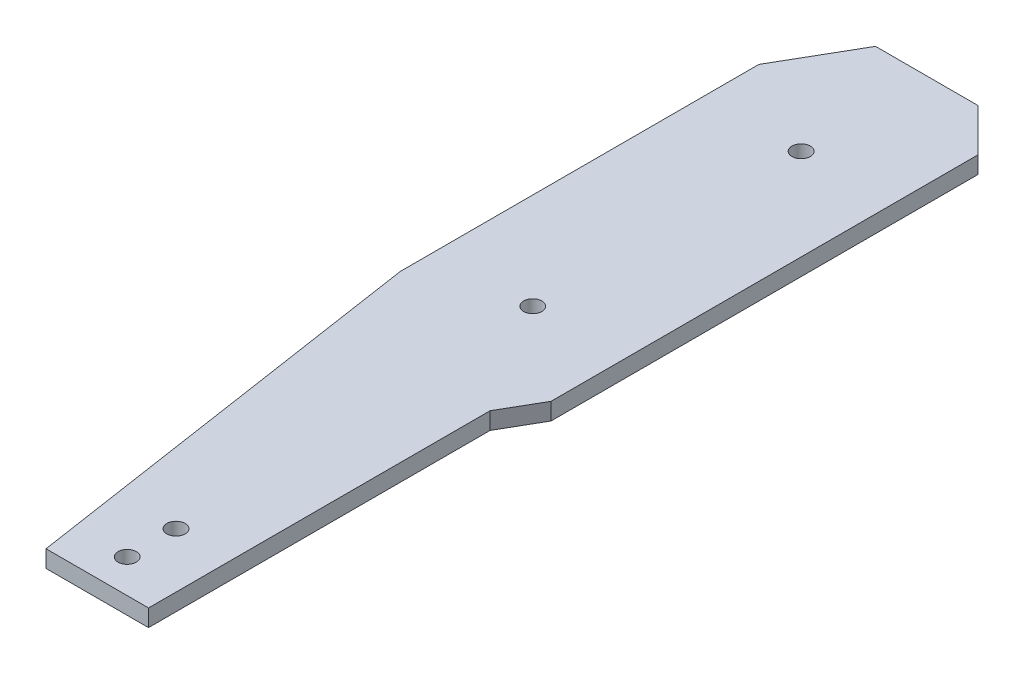
ISO-10303-21;
HEADER;
FILE_DESCRIPTION(('STEP AP214'),'2;1');
FILE_NAME('part.step','',(''),(''),'','','');
FILE_SCHEMA(('AUTOMOTIVE_DESIGN { 1 0 10303 214 1 1 1 1 }'));
ENDSEC;
DATA;
#1=APPLICATION_CONTEXT('core data for automotive mechanical design processes');
#2=APPLICATION_PROTOCOL_DEFINITION('international standard','automotive_design',2000,#1);
#3=PRODUCT_CONTEXT('',#1,'mechanical');
#4=PRODUCT('Part','Part','',(#3));
#5=PRODUCT_RELATED_PRODUCT_CATEGORY('part','',(#4));
#6=PRODUCT_DEFINITION_FORMATION('','',#4);
#7=PRODUCT_DEFINITION_CONTEXT('part definition',#1,'design');
#8=PRODUCT_DEFINITION('design','',#6,#7);
#9=PRODUCT_DEFINITION_SHAPE('','',#8);
#10=(LENGTH_UNIT() NAMED_UNIT(*) SI_UNIT(.MILLI.,.METRE.));
#11=(NAMED_UNIT(*) PLANE_ANGLE_UNIT() SI_UNIT($,.RADIAN.));
#12=(NAMED_UNIT(*) SI_UNIT($,.STERADIAN.) SOLID_ANGLE_UNIT());
#13=UNCERTAINTY_MEASURE_WITH_UNIT(LENGTH_MEASURE(1.E-05),#10,'distance_accuracy_value','');
#14=(GEOMETRIC_REPRESENTATION_CONTEXT(3) GLOBAL_UNCERTAINTY_ASSIGNED_CONTEXT((#13)) GLOBAL_UNIT_ASSIGNED_CONTEXT((#10,
#11,#12)) REPRESENTATION_CONTEXT('',''));
#15=CARTESIAN_POINT('',(0.,0.,0.));
#16=DIRECTION('',(0.,0.,1.));
#17=DIRECTION('',(1.,0.,0.));
#18=AXIS2_PLACEMENT_3D('',#15,#16,#17);
#19=CARTESIAN_POINT('',(11.0006442925217,2.4,-72.5139862302894));
#20=DIRECTION('',(-0.707106781186549,0.,0.707106781186546));
#21=DIRECTION('',(0.707106781186546,0.,0.707106781186549));
#22=AXIS2_PLACEMENT_3D('',#19,#20,#21);
#23=PLANE('',#22);
#24=DIRECTION('',(-0.707106781186546,0.,-0.707106781186549));
#25=VECTOR('',#24,1.);
#26=CARTESIAN_POINT('',(11.0006442925217,-0.4,-72.5139862302894));
#27=LINE('',#26,#25);
#28=CARTESIAN_POINT('',(11.0006442925217,-0.4,-72.5139862302894));
#29=VERTEX_POINT('',#28);
#30=CARTESIAN_POINT('',(4.00064429252166,-0.4,-79.5139862302895));
#31=VERTEX_POINT('',#30);
#32=EDGE_CURVE('E137',#29,#31,#27,.T.);
#33=ORIENTED_EDGE('',*,*,#32,.T.);
#34=DIRECTION('',(0.,-1.,0.));
#35=VECTOR('',#34,1.);
#36=CARTESIAN_POINT('',(4.00064429252166,2.4,-79.5139862302895));
#37=LINE('',#36,#35);
#38=CARTESIAN_POINT('',(4.00064429252166,2.4,-79.5139862302895));
#39=VERTEX_POINT('',#38);
#40=EDGE_CURVE('E11',#39,#31,#37,.T.);
#41=ORIENTED_EDGE('',*,*,#40,.F.);
#42=DIRECTION('',(-0.707106781186546,0.,-0.707106781186549));
#43=VECTOR('',#42,1.);
#44=CARTESIAN_POINT('',(11.0006442925217,2.4,-72.5139862302894));
#45=LINE('',#44,#43);
#46=CARTESIAN_POINT('',(11.0006442925217,2.4,-72.5139862302894));
#47=VERTEX_POINT('',#46);
#48=EDGE_CURVE('E154',#47,#39,#45,.T.);
#49=ORIENTED_EDGE('',*,*,#48,.F.);
#50=DIRECTION('',(0.,-1.,0.));
#51=VECTOR('',#50,1.);
#52=CARTESIAN_POINT('',(11.0006442925217,2.4,-72.5139862302894));
#53=LINE('',#52,#51);
#54=EDGE_CURVE('E133',#47,#29,#53,.T.);
#55=ORIENTED_EDGE('',*,*,#54,.T.);
#56=EDGE_LOOP('',(#33,#41,#49,#55));
#57=FACE_BOUND('',#56,.T.);
#58=ADVANCED_FACE('F35',(#57),#23,.F.);
#59=CARTESIAN_POINT('',(4.00064429252166,2.4,-79.5139862302895));
#60=DIRECTION('',(0.,0.,1.));
#61=DIRECTION('',(1.,0.,0.));
#62=AXIS2_PLACEMENT_3D('',#59,#60,#61);
#63=PLANE('',#62);
#64=DIRECTION('',(-1.,0.,0.));
#65=VECTOR('',#64,1.);
#66=CARTESIAN_POINT('',(4.00064429252166,-0.4,-79.5139862302895));
#67=LINE('',#66,#65);
#68=CARTESIAN_POINT('',(-12.7993557074783,-0.4,-79.5139862302895));
#69=VERTEX_POINT('',#68);
#70=EDGE_CURVE('E140',#31,#69,#67,.T.);
#71=ORIENTED_EDGE('',*,*,#70,.T.);
#72=DIRECTION('',(0.,-1.,0.));
#73=VECTOR('',#72,1.);
#74=CARTESIAN_POINT('',(-12.7993557074783,2.4,-79.5139862302895));
#75=LINE('',#74,#73);
#76=CARTESIAN_POINT('',(-12.7993557074783,2.4,-79.5139862302895));
#77=VERTEX_POINT('',#76);
#78=EDGE_CURVE('E43',#77,#69,#75,.T.);
#79=ORIENTED_EDGE('',*,*,#78,.F.);
#80=DIRECTION('',(-1.,0.,0.));
#81=VECTOR('',#80,1.);
#82=CARTESIAN_POINT('',(4.00064429252166,2.4,-79.5139862302895));
#83=LINE('',#82,#81);
#84=EDGE_CURVE('E97',#39,#77,#83,.T.);
#85=ORIENTED_EDGE('',*,*,#84,.F.);
#86=ORIENTED_EDGE('',*,*,#40,.T.);
#87=EDGE_LOOP('',(#71,#79,#85,#86));
#88=FACE_BOUND('',#87,.T.);
#89=ADVANCED_FACE('F252',(#88),#63,.F.);
#90=CARTESIAN_POINT('',(-12.7993557074783,2.4,-79.5139862302895));
#91=DIRECTION('',(0.866025403784441,0.,0.499999999999997));
#92=DIRECTION('',(0.499999999999997,0.,-0.866025403784441));
#93=AXIS2_PLACEMENT_3D('',#90,#91,#92);
#94=PLANE('',#93);
#95=DIRECTION('',(-0.499999999999997,0.,0.866025403784441));
#96=VECTOR('',#95,1.);
#97=CARTESIAN_POINT('',(-12.7993557074783,-0.4,-79.5139862302895));
#98=LINE('',#97,#96);
#99=CARTESIAN_POINT('',(-19.7993557074783,-0.4,-67.3896305773073));
#100=VERTEX_POINT('',#99);
#101=EDGE_CURVE('E143',#69,#100,#98,.T.);
#102=ORIENTED_EDGE('',*,*,#101,.T.);
#103=DIRECTION('',(0.,-1.,0.));
#104=VECTOR('',#103,1.);
#105=CARTESIAN_POINT('',(-19.7993557074783,2.4,-67.3896305773073));
#106=LINE('',#105,#104);
#107=CARTESIAN_POINT('',(-19.7993557074783,2.4,-67.3896305773073));
#108=VERTEX_POINT('',#107);
#109=EDGE_CURVE('E164',#108,#100,#106,.T.);
#110=ORIENTED_EDGE('',*,*,#109,.F.);
#111=DIRECTION('',(-0.499999999999997,0.,0.866025403784441));
#112=VECTOR('',#111,1.);
#113=CARTESIAN_POINT('',(-12.7993557074783,2.4,-79.5139862302895));
#114=LINE('',#113,#112);
#115=EDGE_CURVE('E172',#77,#108,#114,.T.);
#116=ORIENTED_EDGE('',*,*,#115,.F.);
#117=ORIENTED_EDGE('',*,*,#78,.T.);
#118=EDGE_LOOP('',(#102,#110,#116,#117));
#119=FACE_BOUND('',#118,.T.);
#120=ADVANCED_FACE('F170',(#119),#94,.F.);
#121=CARTESIAN_POINT('',(-19.7993557074783,2.4,-67.3896305773073));
#122=DIRECTION('',(1.,0.,0.));
#123=DIRECTION('',(0.,0.,-1.));
#124=AXIS2_PLACEMENT_3D('',#121,#122,#123);
#125=PLANE('',#124);
#126=DIRECTION('',(0.,0.,1.));
#127=VECTOR('',#126,1.);
#128=CARTESIAN_POINT('',(-19.7993557074783,-0.4,-67.3896305773073));
#129=LINE('',#128,#127);
#130=CARTESIAN_POINT('',(-19.7993557074783,-0.4,-8.58963057730734));
#131=VERTEX_POINT('',#130);
#132=EDGE_CURVE('E145',#100,#131,#129,.T.);
#133=ORIENTED_EDGE('',*,*,#132,.T.);
#134=DIRECTION('',(0.,-1.,0.));
#135=VECTOR('',#134,1.);
#136=CARTESIAN_POINT('',(-19.7993557074783,2.4,-8.58963057730734));
#137=LINE('',#136,#135);
#138=CARTESIAN_POINT('',(-19.7993557074783,2.4,-8.58963057730734));
#139=VERTEX_POINT('',#138);
#140=EDGE_CURVE('E161',#139,#131,#137,.T.);
#141=ORIENTED_EDGE('',*,*,#140,.F.);
#142=DIRECTION('',(0.,0.,1.));
#143=VECTOR('',#142,1.);
#144=CARTESIAN_POINT('',(-19.7993557074783,2.4,-67.3896305773073));
#145=LINE('',#144,#143);
#146=EDGE_CURVE('E188',#108,#139,#145,.T.);
#147=ORIENTED_EDGE('',*,*,#146,.F.);
#148=ORIENTED_EDGE('',*,*,#109,.T.);
#149=EDGE_LOOP('',(#133,#141,#147,#148));
#150=FACE_BOUND('',#149,.T.);
#151=ADVANCED_FACE('F181',(#150),#125,.F.);
#152=CARTESIAN_POINT('',(-19.7993557074783,2.4,-8.58963057730734));
#153=DIRECTION('',(0.98878955641678,0.,-0.149315816714463));
#154=DIRECTION('',(-0.149315816714463,0.,-0.98878955641678));
#155=AXIS2_PLACEMENT_3D('',#152,#153,#154);
#156=PLANE('',#155);
#157=DIRECTION('',(0.149315816714463,0.,0.98878955641678));
#158=VECTOR('',#157,1.);
#159=CARTESIAN_POINT('',(-19.7993557074783,-0.4,-8.58963057730734));
#160=LINE('',#159,#158);
#161=CARTESIAN_POINT('',(-9.46839493803335,-0.4,59.8233905034605));
#162=VERTEX_POINT('',#161);
#163=EDGE_CURVE('E147',#131,#162,#160,.T.);
#164=ORIENTED_EDGE('',*,*,#163,.T.);
#165=DIRECTION('',(0.,-1.,0.));
#166=VECTOR('',#165,1.);
#167=CARTESIAN_POINT('',(-9.46839493803335,2.4,59.8233905034605));
#168=LINE('',#167,#166);
#169=CARTESIAN_POINT('',(-9.46839493803335,2.4,59.8233905034605));
#170=VERTEX_POINT('',#169);
#171=EDGE_CURVE('E158',#170,#162,#168,.T.);
#172=ORIENTED_EDGE('',*,*,#171,.F.);
#173=DIRECTION('',(0.149315816714463,0.,0.98878955641678));
#174=VECTOR('',#173,1.);
#175=CARTESIAN_POINT('',(-19.7993557074783,2.4,-8.58963057730734));
#176=LINE('',#175,#174);
#177=EDGE_CURVE('E187',#139,#170,#176,.T.);
#178=ORIENTED_EDGE('',*,*,#177,.F.);
#179=ORIENTED_EDGE('',*,*,#140,.T.);
#180=EDGE_LOOP('',(#164,#172,#178,#179));
#181=FACE_BOUND('',#180,.T.);
#182=ADVANCED_FACE('F185',(#181),#156,.F.);
#183=CARTESIAN_POINT('',(-9.46839493803335,2.4,59.8233905034605));
#184=DIRECTION('',(0.,0.,-1.));
#185=DIRECTION('',(-1.,0.,0.));
#186=AXIS2_PLACEMENT_3D('',#183,#184,#185);
#187=PLANE('',#186);
#188=DIRECTION('',(1.,0.,0.));
#189=VECTOR('',#188,1.);
#190=CARTESIAN_POINT('',(-9.46839493803335,-0.4,59.8233905034605));
#191=LINE('',#190,#189);
#192=CARTESIAN_POINT('',(7.34175812933514,-0.4,59.8233905034605));
#193=VERTEX_POINT('',#192);
#194=EDGE_CURVE('E149',#162,#193,#191,.T.);
#195=ORIENTED_EDGE('',*,*,#194,.T.);
#196=DIRECTION('',(0.,-1.,0.));
#197=VECTOR('',#196,1.);
#198=CARTESIAN_POINT('',(7.34175812933514,2.4,59.8233905034605));
#199=LINE('',#198,#197);
#200=CARTESIAN_POINT('',(7.34175812933514,2.4,59.8233905034605));
#201=VERTEX_POINT('',#200);
#202=EDGE_CURVE('E128',#201,#193,#199,.T.);
#203=ORIENTED_EDGE('',*,*,#202,.F.);
#204=DIRECTION('',(1.,0.,0.));
#205=VECTOR('',#204,1.);
#206=CARTESIAN_POINT('',(-9.46839493803335,2.4,59.8233905034605));
#207=LINE('',#206,#205);
#208=EDGE_CURVE('E119',#170,#201,#207,.T.);
#209=ORIENTED_EDGE('',*,*,#208,.F.);
#210=ORIENTED_EDGE('',*,*,#171,.T.);
#211=EDGE_LOOP('',(#195,#203,#209,#210));
#212=FACE_BOUND('',#211,.T.);
#213=ADVANCED_FACE('F260',(#212),#187,.F.);
#214=CARTESIAN_POINT('',(7.34175812933514,2.4,59.8233905034605));
#215=DIRECTION('',(-1.,0.,0.));
#216=DIRECTION('',(0.,0.,1.));
#217=AXIS2_PLACEMENT_3D('',#214,#215,#216);
#218=PLANE('',#217);
#219=DIRECTION('',(0.,0.,-1.));
#220=VECTOR('',#219,1.);
#221=CARTESIAN_POINT('',(7.34175812933514,-0.4,59.8233905034605));
#222=LINE('',#221,#220);
#223=CARTESIAN_POINT('',(7.34175812933515,-0.4,3.82339050346049));
#224=VERTEX_POINT('',#223);
#225=EDGE_CURVE('E127',#193,#224,#222,.T.);
#226=ORIENTED_EDGE('',*,*,#225,.T.);
#227=DIRECTION('',(0.,-1.,0.));
#228=VECTOR('',#227,1.);
#229=CARTESIAN_POINT('',(7.34175812933515,2.4,3.82339050346049));
#230=LINE('',#229,#228);
#231=CARTESIAN_POINT('',(7.34175812933515,2.4,3.82339050346049));
#232=VERTEX_POINT('',#231);
#233=EDGE_CURVE('E124',#232,#224,#230,.T.);
#234=ORIENTED_EDGE('',*,*,#233,.F.);
#235=DIRECTION('',(0.,0.,-1.));
#236=VECTOR('',#235,1.);
#237=CARTESIAN_POINT('',(7.34175812933514,2.4,59.8233905034605));
#238=LINE('',#237,#236);
#239=EDGE_CURVE('E113',#201,#232,#238,.T.);
#240=ORIENTED_EDGE('',*,*,#239,.F.);
#241=ORIENTED_EDGE('',*,*,#202,.T.);
#242=EDGE_LOOP('',(#226,#234,#240,#241));
#243=FACE_BOUND('',#242,.T.);
#244=ADVANCED_FACE('F125',(#243),#218,.F.);
#245=CARTESIAN_POINT('',(7.34175812933515,2.4,3.82339050346049));
#246=DIRECTION('',(-0.86602540378444,0.,-0.499999999999997));
#247=DIRECTION('',(-0.499999999999997,0.,0.86602540378444));
#248=AXIS2_PLACEMENT_3D('',#245,#246,#247);
#249=PLANE('',#248);
#250=DIRECTION('',(0.499999999999997,0.,-0.86602540378444));
#251=VECTOR('',#250,1.);
#252=CARTESIAN_POINT('',(7.34175812933515,-0.4,3.82339050346049));
#253=LINE('',#252,#251);
#254=CARTESIAN_POINT('',(11.0006442925217,-0.4,-2.51398623028944));
#255=VERTEX_POINT('',#254);
#256=EDGE_CURVE('E83',#224,#255,#253,.T.);
#257=ORIENTED_EDGE('',*,*,#256,.T.);
#258=DIRECTION('',(0.,-1.,0.));
#259=VECTOR('',#258,1.);
#260=CARTESIAN_POINT('',(11.0006442925217,2.4,-2.51398623028944));
#261=LINE('',#260,#259);
#262=CARTESIAN_POINT('',(11.0006442925217,2.4,-2.51398623028944));
#263=VERTEX_POINT('',#262);
#264=EDGE_CURVE('E129',#263,#255,#261,.T.);
#265=ORIENTED_EDGE('',*,*,#264,.F.);
#266=DIRECTION('',(0.499999999999997,0.,-0.86602540378444));
#267=VECTOR('',#266,1.);
#268=CARTESIAN_POINT('',(7.34175812933515,2.4,3.82339050346049));
#269=LINE('',#268,#267);
#270=EDGE_CURVE('E117',#232,#263,#269,.T.);
#271=ORIENTED_EDGE('',*,*,#270,.F.);
#272=ORIENTED_EDGE('',*,*,#233,.T.);
#273=EDGE_LOOP('',(#257,#265,#271,#272));
#274=FACE_BOUND('',#273,.T.);
#275=ADVANCED_FACE('F131',(#274),#249,.F.);
#276=CARTESIAN_POINT('',(11.0006442925217,2.4,-2.51398623028944));
#277=DIRECTION('',(-1.,0.,0.));
#278=DIRECTION('',(0.,0.,1.));
#279=AXIS2_PLACEMENT_3D('',#276,#277,#278);
#280=PLANE('',#279);
#281=DIRECTION('',(0.,0.,-1.));
#282=VECTOR('',#281,1.);
#283=CARTESIAN_POINT('',(11.0006442925217,-0.4,-2.51398623028944));
#284=LINE('',#283,#282);
#285=EDGE_CURVE('E89',#255,#29,#284,.T.);
#286=ORIENTED_EDGE('',*,*,#285,.T.);
#287=ORIENTED_EDGE('',*,*,#54,.F.);
#288=DIRECTION('',(0.,0.,-1.));
#289=VECTOR('',#288,1.);
#290=CARTESIAN_POINT('',(11.0006442925217,2.4,-2.51398623028944));
#291=LINE('',#290,#289);
#292=EDGE_CURVE('E51',#263,#47,#291,.T.);
#293=ORIENTED_EDGE('',*,*,#292,.F.);
#294=ORIENTED_EDGE('',*,*,#264,.T.);
#295=EDGE_LOOP('',(#286,#287,#293,#294));
#296=FACE_BOUND('',#295,.T.);
#297=ADVANCED_FACE('F230',(#296),#280,.F.);
#298=CARTESIAN_POINT('',(1.59397787211385,2.4,6.21441398360088));
#299=DIRECTION('',(0.,1.,0.));
#300=DIRECTION('',(0.,0.,1.));
#301=AXIS2_PLACEMENT_3D('',#298,#299,#300);
#302=PLANE('',#301);
#303=CARTESIAN_POINT('',(-1.65824187066486,2.4,46.3233905034605));
#304=DIRECTION('',(0.,1.,0.));
#305=DIRECTION('',(0.,0.,1.));
#306=AXIS2_PLACEMENT_3D('',#303,#304,#305);
#307=CIRCLE('',#306,1.5);
#308=CARTESIAN_POINT('',(-1.65824187066486,2.4,47.8233905034605));
#309=VERTEX_POINT('',#308);
#310=EDGE_CURVE('E213',#309,#309,#307,.T.);
#311=ORIENTED_EDGE('',*,*,#310,.F.);
#312=EDGE_LOOP('',(#311));
#313=FACE_BOUND('',#312,.T.);
#314=CARTESIAN_POINT('',(-1.65824187066485,2.4,54.3233905034605));
#315=DIRECTION('',(0.,1.,0.));
#316=DIRECTION('',(0.,0.,1.));
#317=AXIS2_PLACEMENT_3D('',#314,#315,#316);
#318=CIRCLE('',#317,1.5);
#319=CARTESIAN_POINT('',(-1.65824187066485,2.4,55.8233905034605));
#320=VERTEX_POINT('',#319);
#321=EDGE_CURVE('E207',#320,#320,#318,.T.);
#322=ORIENTED_EDGE('',*,*,#321,.F.);
#323=EDGE_LOOP('',(#322));
#324=FACE_BOUND('',#323,.T.);
#325=CARTESIAN_POINT('',(-3.99935570747828,2.4,-14.5139862302895));
#326=DIRECTION('',(0.,1.,0.));
#327=DIRECTION('',(0.,0.,1.));
#328=AXIS2_PLACEMENT_3D('',#325,#326,#327);
#329=CIRCLE('',#328,1.5);
#330=CARTESIAN_POINT('',(-3.99935570747828,2.4,-13.0139862302895));
#331=VERTEX_POINT('',#330);
#332=EDGE_CURVE('E202',#331,#331,#329,.T.);
#333=ORIENTED_EDGE('',*,*,#332,.F.);
#334=EDGE_LOOP('',(#333));
#335=FACE_BOUND('',#334,.T.);
#336=CARTESIAN_POINT('',(-3.99935570747828,2.4,-58.5139862302895));
#337=DIRECTION('',(0.,1.,0.));
#338=DIRECTION('',(0.,0.,1.));
#339=AXIS2_PLACEMENT_3D('',#336,#337,#338);
#340=CIRCLE('',#339,1.5);
#341=CARTESIAN_POINT('',(-3.99935570747828,2.4,-57.0139862302895));
#342=VERTEX_POINT('',#341);
#343=EDGE_CURVE('E195',#342,#342,#340,.T.);
#344=ORIENTED_EDGE('',*,*,#343,.F.);
#345=EDGE_LOOP('',(#344));
#346=FACE_BOUND('',#345,.T.);
#347=ORIENTED_EDGE('',*,*,#48,.T.);
#348=ORIENTED_EDGE('',*,*,#84,.T.);
#349=ORIENTED_EDGE('',*,*,#115,.T.);
#350=ORIENTED_EDGE('',*,*,#146,.T.);
#351=ORIENTED_EDGE('',*,*,#177,.T.);
#352=ORIENTED_EDGE('',*,*,#208,.T.);
#353=ORIENTED_EDGE('',*,*,#239,.T.);
#354=ORIENTED_EDGE('',*,*,#270,.T.);
#355=ORIENTED_EDGE('',*,*,#292,.T.);
#356=EDGE_LOOP('',(#347,#348,#349,#350,#351,#352,#353,#354,#355));
#357=FACE_BOUND('',#356,.T.);
#358=ADVANCED_FACE('F115',(#313,#324,#335,#346,#357),#302,.T.);
#359=CARTESIAN_POINT('',(1.59397787211385,-0.4,6.21441398360088));
#360=DIRECTION('',(0.,1.,0.));
#361=DIRECTION('',(0.,0.,1.));
#362=AXIS2_PLACEMENT_3D('',#359,#360,#361);
#363=PLANE('',#362);
#364=CARTESIAN_POINT('',(-1.65824187066486,-0.4,46.3233905034605));
#365=DIRECTION('',(0.,1.,0.));
#366=DIRECTION('',(0.,0.,1.));
#367=AXIS2_PLACEMENT_3D('',#364,#365,#366);
#368=CIRCLE('',#367,1.5);
#369=CARTESIAN_POINT('',(-1.65824187066486,-0.4,47.8233905034605));
#370=VERTEX_POINT('',#369);
#371=EDGE_CURVE('E199',#370,#370,#368,.T.);
#372=ORIENTED_EDGE('',*,*,#371,.T.);
#373=EDGE_LOOP('',(#372));
#374=FACE_BOUND('',#373,.T.);
#375=CARTESIAN_POINT('',(-1.65824187066485,-0.4,54.3233905034605));
#376=DIRECTION('',(0.,1.,0.));
#377=DIRECTION('',(0.,0.,1.));
#378=AXIS2_PLACEMENT_3D('',#375,#376,#377);
#379=CIRCLE('',#378,1.5);
#380=CARTESIAN_POINT('',(-1.65824187066485,-0.4,55.8233905034605));
#381=VERTEX_POINT('',#380);
#382=EDGE_CURVE('E210',#381,#381,#379,.T.);
#383=ORIENTED_EDGE('',*,*,#382,.T.);
#384=EDGE_LOOP('',(#383));
#385=FACE_BOUND('',#384,.T.);
#386=CARTESIAN_POINT('',(-3.99935570747828,-0.4,-14.5139862302895));
#387=DIRECTION('',(0.,1.,0.));
#388=DIRECTION('',(0.,0.,1.));
#389=AXIS2_PLACEMENT_3D('',#386,#387,#388);
#390=CIRCLE('',#389,1.5);
#391=CARTESIAN_POINT('',(-3.99935570747828,-0.4,-13.0139862302895));
#392=VERTEX_POINT('',#391);
#393=EDGE_CURVE('E141',#392,#392,#390,.T.);
#394=ORIENTED_EDGE('',*,*,#393,.T.);
#395=EDGE_LOOP('',(#394));
#396=FACE_BOUND('',#395,.T.);
#397=CARTESIAN_POINT('',(-3.99935570747828,-0.4,-58.5139862302895));
#398=DIRECTION('',(0.,1.,0.));
#399=DIRECTION('',(0.,0.,1.));
#400=AXIS2_PLACEMENT_3D('',#397,#398,#399);
#401=CIRCLE('',#400,1.5);
#402=CARTESIAN_POINT('',(-3.99935570747828,-0.4,-57.0139862302895));
#403=VERTEX_POINT('',#402);
#404=EDGE_CURVE('E198',#403,#403,#401,.T.);
#405=ORIENTED_EDGE('',*,*,#404,.T.);
#406=EDGE_LOOP('',(#405));
#407=FACE_BOUND('',#406,.T.);
#408=ORIENTED_EDGE('',*,*,#32,.F.);
#409=ORIENTED_EDGE('',*,*,#285,.F.);
#410=ORIENTED_EDGE('',*,*,#256,.F.);
#411=ORIENTED_EDGE('',*,*,#225,.F.);
#412=ORIENTED_EDGE('',*,*,#194,.F.);
#413=ORIENTED_EDGE('',*,*,#163,.F.);
#414=ORIENTED_EDGE('',*,*,#132,.F.);
#415=ORIENTED_EDGE('',*,*,#101,.F.);
#416=ORIENTED_EDGE('',*,*,#70,.F.);
#417=EDGE_LOOP('',(#408,#409,#410,#411,#412,#413,#414,#415,#416));
#418=FACE_BOUND('',#417,.T.);
#419=ADVANCED_FACE('F176',(#374,#385,#396,#407,#418),#363,.F.);
#420=CARTESIAN_POINT('',(-3.99935570747828,-0.4,-58.5139862302895));
#421=DIRECTION('',(0.,1.,0.));
#422=DIRECTION('',(0.,0.,1.));
#423=AXIS2_PLACEMENT_3D('',#420,#421,#422);
#424=CYLINDRICAL_SURFACE('',#423,1.5);
#425=ORIENTED_EDGE('',*,*,#404,.F.);
#426=EDGE_LOOP('',(#425));
#427=FACE_BOUND('',#426,.T.);
#428=ORIENTED_EDGE('',*,*,#343,.T.);
#429=EDGE_LOOP('',(#428));
#430=FACE_BOUND('',#429,.T.);
#431=ADVANCED_FACE('F238',(#427,#430),#424,.F.);
#432=CARTESIAN_POINT('',(-3.99935570747828,-0.4,-14.5139862302895));
#433=DIRECTION('',(0.,1.,0.));
#434=DIRECTION('',(0.,0.,1.));
#435=AXIS2_PLACEMENT_3D('',#432,#433,#434);
#436=CYLINDRICAL_SURFACE('',#435,1.5);
#437=ORIENTED_EDGE('',*,*,#393,.F.);
#438=EDGE_LOOP('',(#437));
#439=FACE_BOUND('',#438,.T.);
#440=ORIENTED_EDGE('',*,*,#332,.T.);
#441=EDGE_LOOP('',(#440));
#442=FACE_BOUND('',#441,.T.);
#443=ADVANCED_FACE('F240',(#439,#442),#436,.F.);
#444=CARTESIAN_POINT('',(-1.65824187066485,-0.4,54.3233905034605));
#445=DIRECTION('',(0.,1.,0.));
#446=DIRECTION('',(0.,0.,1.));
#447=AXIS2_PLACEMENT_3D('',#444,#445,#446);
#448=CYLINDRICAL_SURFACE('',#447,1.5);
#449=ORIENTED_EDGE('',*,*,#382,.F.);
#450=EDGE_LOOP('',(#449));
#451=FACE_BOUND('',#450,.T.);
#452=ORIENTED_EDGE('',*,*,#321,.T.);
#453=EDGE_LOOP('',(#452));
#454=FACE_BOUND('',#453,.T.);
#455=ADVANCED_FACE('F224',(#451,#454),#448,.F.);
#456=CARTESIAN_POINT('',(-1.65824187066486,-0.4,46.3233905034605));
#457=DIRECTION('',(0.,1.,0.));
#458=DIRECTION('',(0.,0.,1.));
#459=AXIS2_PLACEMENT_3D('',#456,#457,#458);
#460=CYLINDRICAL_SURFACE('',#459,1.5);
#461=ORIENTED_EDGE('',*,*,#371,.F.);
#462=EDGE_LOOP('',(#461));
#463=FACE_BOUND('',#462,.T.);
#464=ORIENTED_EDGE('',*,*,#310,.T.);
#465=EDGE_LOOP('',(#464));
#466=FACE_BOUND('',#465,.T.);
#467=ADVANCED_FACE('F221',(#463,#466),#460,.F.);
#468=CLOSED_SHELL('',(#58,#89,#120,#151,#182,#213,#244,#275,#297,#358,#419,#431,#443,#455,#467));
#469=MANIFOLD_SOLID_BREP('B2',#468);
#470=ADVANCED_BREP_SHAPE_REPRESENTATION('',(#18,#469),#14);
#471=SHAPE_DEFINITION_REPRESENTATION(#9,#470);
ENDSEC;
END-ISO-10303-21;
